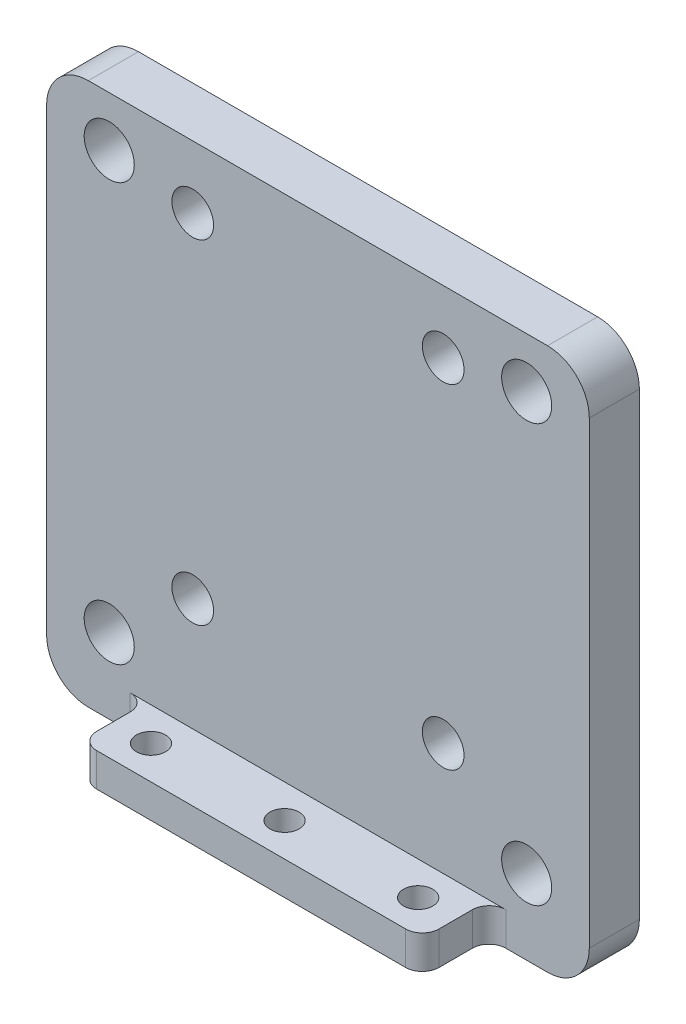
ISO-10303-21;
HEADER;
FILE_DESCRIPTION(('STEP AP214'),'2;1');
FILE_NAME('part.step','',(''),(''),'','','');
FILE_SCHEMA(('AUTOMOTIVE_DESIGN { 1 0 10303 214 1 1 1 1 }'));
ENDSEC;
DATA;
#1=APPLICATION_CONTEXT('core data for automotive mechanical design processes');
#2=APPLICATION_PROTOCOL_DEFINITION('international standard','automotive_design',2000,#1);
#3=PRODUCT_CONTEXT('',#1,'mechanical');
#4=PRODUCT('Part','Part','',(#3));
#5=PRODUCT_RELATED_PRODUCT_CATEGORY('part','',(#4));
#6=PRODUCT_DEFINITION_FORMATION('','',#4);
#7=PRODUCT_DEFINITION_CONTEXT('part definition',#1,'design');
#8=PRODUCT_DEFINITION('design','',#6,#7);
#9=PRODUCT_DEFINITION_SHAPE('','',#8);
#10=(LENGTH_UNIT() NAMED_UNIT(*) SI_UNIT(.MILLI.,.METRE.));
#11=(NAMED_UNIT(*) PLANE_ANGLE_UNIT() SI_UNIT($,.RADIAN.));
#12=(NAMED_UNIT(*) SI_UNIT($,.STERADIAN.) SOLID_ANGLE_UNIT());
#13=UNCERTAINTY_MEASURE_WITH_UNIT(LENGTH_MEASURE(1.E-05),#10,'distance_accuracy_value','');
#14=(GEOMETRIC_REPRESENTATION_CONTEXT(3) GLOBAL_UNCERTAINTY_ASSIGNED_CONTEXT((#13)) GLOBAL_UNIT_ASSIGNED_CONTEXT((#10,
#11,#12)) REPRESENTATION_CONTEXT('',''));
#15=CARTESIAN_POINT('',(0.,0.,0.));
#16=DIRECTION('',(0.,0.,1.));
#17=DIRECTION('',(1.,0.,0.));
#18=AXIS2_PLACEMENT_3D('',#15,#16,#17);
#19=CARTESIAN_POINT('',(0.,0.,6.));
#20=DIRECTION('',(0.,0.,1.));
#21=DIRECTION('',(1.,0.,0.));
#22=AXIS2_PLACEMENT_3D('',#19,#20,#21);
#23=PLANE('',#22);
#24=CARTESIAN_POINT('',(-15.,25.,6.));
#25=DIRECTION('',(0.,0.,1.));
#26=DIRECTION('',(1.,0.,0.));
#27=AXIS2_PLACEMENT_3D('',#24,#25,#26);
#28=CIRCLE('',#27,2.5);
#29=CARTESIAN_POINT('',(-12.5,25.,6.));
#30=VERTEX_POINT('',#29);
#31=EDGE_CURVE('E340',#30,#30,#28,.T.);
#32=ORIENTED_EDGE('',*,*,#31,.F.);
#33=EDGE_LOOP('',(#32));
#34=FACE_BOUND('',#33,.T.);
#35=CARTESIAN_POINT('',(15.,-15.,6.));
#36=DIRECTION('',(0.,0.,1.));
#37=DIRECTION('',(1.,0.,0.));
#38=AXIS2_PLACEMENT_3D('',#35,#36,#37);
#39=CIRCLE('',#38,2.5);
#40=CARTESIAN_POINT('',(17.5,-15.,6.));
#41=VERTEX_POINT('',#40);
#42=EDGE_CURVE('E336',#41,#41,#39,.T.);
#43=ORIENTED_EDGE('',*,*,#42,.F.);
#44=EDGE_LOOP('',(#43));
#45=FACE_BOUND('',#44,.T.);
#46=CARTESIAN_POINT('',(-15.,-15.,6.));
#47=DIRECTION('',(0.,0.,1.));
#48=DIRECTION('',(1.,0.,0.));
#49=AXIS2_PLACEMENT_3D('',#46,#47,#48);
#50=CIRCLE('',#49,2.5);
#51=CARTESIAN_POINT('',(-12.5,-15.,6.));
#52=VERTEX_POINT('',#51);
#53=EDGE_CURVE('E332',#52,#52,#50,.T.);
#54=ORIENTED_EDGE('',*,*,#53,.F.);
#55=EDGE_LOOP('',(#54));
#56=FACE_BOUND('',#55,.T.);
#57=CARTESIAN_POINT('',(15.,25.,6.));
#58=DIRECTION('',(0.,0.,1.));
#59=DIRECTION('',(1.,0.,0.));
#60=AXIS2_PLACEMENT_3D('',#57,#58,#59);
#61=CIRCLE('',#60,2.5);
#62=CARTESIAN_POINT('',(17.5,25.,6.));
#63=VERTEX_POINT('',#62);
#64=EDGE_CURVE('E328',#63,#63,#61,.T.);
#65=ORIENTED_EDGE('',*,*,#64,.F.);
#66=EDGE_LOOP('',(#65));
#67=FACE_BOUND('',#66,.T.);
#68=DIRECTION('',(-1.,0.,0.));
#69=VECTOR('',#68,1.);
#70=CARTESIAN_POINT('',(-20.5,-28.5,6.));
#71=LINE('',#70,#69);
#72=CARTESIAN_POINT('',(22.5,-28.5,6.));
#73=VERTEX_POINT('',#72);
#74=CARTESIAN_POINT('',(-22.5,-28.5,6.));
#75=VERTEX_POINT('',#74);
#76=EDGE_CURVE('E344',#73,#75,#71,.T.);
#77=ORIENTED_EDGE('',*,*,#76,.F.);
#78=DIRECTION('',(0.,1.,0.));
#79=VECTOR('',#78,1.);
#80=CARTESIAN_POINT('',(22.5,0.,6.));
#81=LINE('',#80,#79);
#82=CARTESIAN_POINT('',(22.5,-32.5,6.));
#83=VERTEX_POINT('',#82);
#84=EDGE_CURVE('E257',#73,#83,#81,.F.);
#85=ORIENTED_EDGE('',*,*,#84,.T.);
#86=DIRECTION('',(1.,0.,0.));
#87=VECTOR('',#86,1.);
#88=CARTESIAN_POINT('',(-32.5,-32.5,6.));
#89=LINE('',#88,#87);
#90=CARTESIAN_POINT('',(27.5,-32.5,6.));
#91=VERTEX_POINT('',#90);
#92=EDGE_CURVE('E405',#83,#91,#89,.T.);
#93=ORIENTED_EDGE('',*,*,#92,.T.);
#94=CARTESIAN_POINT('',(27.5,-27.5,6.));
#95=DIRECTION('',(0.,0.,1.));
#96=DIRECTION('',(1.,0.,0.));
#97=AXIS2_PLACEMENT_3D('',#94,#95,#96);
#98=CIRCLE('',#97,5.);
#99=CARTESIAN_POINT('',(32.5,-27.5,6.));
#100=VERTEX_POINT('',#99);
#101=EDGE_CURVE('E229',#91,#100,#98,.T.);
#102=ORIENTED_EDGE('',*,*,#101,.T.);
#103=DIRECTION('',(0.,1.,0.));
#104=VECTOR('',#103,1.);
#105=CARTESIAN_POINT('',(32.5,32.5,6.));
#106=LINE('',#105,#104);
#107=CARTESIAN_POINT('',(32.5,27.5,6.));
#108=VERTEX_POINT('',#107);
#109=EDGE_CURVE('E176',#100,#108,#106,.T.);
#110=ORIENTED_EDGE('',*,*,#109,.T.);
#111=CARTESIAN_POINT('',(27.5,27.5,6.));
#112=DIRECTION('',(0.,0.,1.));
#113=DIRECTION('',(1.,0.,0.));
#114=AXIS2_PLACEMENT_3D('',#111,#112,#113);
#115=CIRCLE('',#114,5.);
#116=CARTESIAN_POINT('',(27.5,32.5,6.));
#117=VERTEX_POINT('',#116);
#118=EDGE_CURVE('E223',#108,#117,#115,.T.);
#119=ORIENTED_EDGE('',*,*,#118,.T.);
#120=DIRECTION('',(-1.,0.,0.));
#121=VECTOR('',#120,1.);
#122=CARTESIAN_POINT('',(-32.5,32.5,6.));
#123=LINE('',#122,#121);
#124=CARTESIAN_POINT('',(-27.5,32.5,6.));
#125=VERTEX_POINT('',#124);
#126=EDGE_CURVE('E399',#117,#125,#123,.T.);
#127=ORIENTED_EDGE('',*,*,#126,.T.);
#128=CARTESIAN_POINT('',(-27.5,27.5,6.));
#129=DIRECTION('',(0.,0.,1.));
#130=DIRECTION('',(1.,0.,0.));
#131=AXIS2_PLACEMENT_3D('',#128,#129,#130);
#132=CIRCLE('',#131,5.);
#133=CARTESIAN_POINT('',(-32.5,27.5,6.));
#134=VERTEX_POINT('',#133);
#135=EDGE_CURVE('E220',#125,#134,#132,.T.);
#136=ORIENTED_EDGE('',*,*,#135,.T.);
#137=DIRECTION('',(0.,-1.,0.));
#138=VECTOR('',#137,1.);
#139=CARTESIAN_POINT('',(-32.5,32.5,6.));
#140=LINE('',#139,#138);
#141=CARTESIAN_POINT('',(-32.5,-27.5,6.));
#142=VERTEX_POINT('',#141);
#143=EDGE_CURVE('E402',#134,#142,#140,.T.);
#144=ORIENTED_EDGE('',*,*,#143,.T.);
#145=CARTESIAN_POINT('',(-27.5,-27.5,6.));
#146=DIRECTION('',(0.,0.,1.));
#147=DIRECTION('',(1.,0.,0.));
#148=AXIS2_PLACEMENT_3D('',#145,#146,#147);
#149=CIRCLE('',#148,5.);
#150=CARTESIAN_POINT('',(-27.5,-32.5,6.));
#151=VERTEX_POINT('',#150);
#152=EDGE_CURVE('E226',#142,#151,#149,.T.);
#153=ORIENTED_EDGE('',*,*,#152,.T.);
#154=CARTESIAN_POINT('',(-22.5,-32.5,6.));
#155=VERTEX_POINT('',#154);
#156=EDGE_CURVE('E198',#151,#155,#89,.T.);
#157=ORIENTED_EDGE('',*,*,#156,.T.);
#158=DIRECTION('',(0.,-1.,0.));
#159=VECTOR('',#158,1.);
#160=CARTESIAN_POINT('',(-22.5,0.,6.));
#161=LINE('',#160,#159);
#162=EDGE_CURVE('E253',#155,#75,#161,.F.);
#163=ORIENTED_EDGE('',*,*,#162,.T.);
#164=EDGE_LOOP('',(#77,#85,#93,#102,#110,#119,#127,#136,#144,#153,#157,#163));
#165=FACE_BOUND('',#164,.T.);
#166=CARTESIAN_POINT('',(-25.,-23.5,6.));
#167=DIRECTION('',(0.,0.,1.));
#168=DIRECTION('',(1.,0.,0.));
#169=AXIS2_PLACEMENT_3D('',#166,#167,#168);
#170=CIRCLE('',#169,3.);
#171=CARTESIAN_POINT('',(-22.,-23.5,6.));
#172=VERTEX_POINT('',#171);
#173=EDGE_CURVE('E379',#172,#172,#170,.T.);
#174=ORIENTED_EDGE('',*,*,#173,.F.);
#175=EDGE_LOOP('',(#174));
#176=FACE_BOUND('',#175,.T.);
#177=CARTESIAN_POINT('',(25.,26.5,6.));
#178=DIRECTION('',(0.,0.,1.));
#179=DIRECTION('',(1.,0.,0.));
#180=AXIS2_PLACEMENT_3D('',#177,#178,#179);
#181=CIRCLE('',#180,3.);
#182=CARTESIAN_POINT('',(28.,26.5,6.));
#183=VERTEX_POINT('',#182);
#184=EDGE_CURVE('E187',#183,#183,#181,.T.);
#185=ORIENTED_EDGE('',*,*,#184,.F.);
#186=EDGE_LOOP('',(#185));
#187=FACE_BOUND('',#186,.T.);
#188=CARTESIAN_POINT('',(25.,-23.5,6.));
#189=DIRECTION('',(0.,0.,1.));
#190=DIRECTION('',(1.,0.,0.));
#191=AXIS2_PLACEMENT_3D('',#188,#189,#190);
#192=CIRCLE('',#191,3.);
#193=CARTESIAN_POINT('',(28.,-23.5,6.));
#194=VERTEX_POINT('',#193);
#195=EDGE_CURVE('E387',#194,#194,#192,.T.);
#196=ORIENTED_EDGE('',*,*,#195,.F.);
#197=EDGE_LOOP('',(#196));
#198=FACE_BOUND('',#197,.T.);
#199=CARTESIAN_POINT('',(-25.,26.5,6.));
#200=DIRECTION('',(0.,0.,1.));
#201=DIRECTION('',(1.,0.,0.));
#202=AXIS2_PLACEMENT_3D('',#199,#200,#201);
#203=CIRCLE('',#202,3.);
#204=CARTESIAN_POINT('',(-22.,26.5,6.));
#205=VERTEX_POINT('',#204);
#206=EDGE_CURVE('E371',#205,#205,#203,.T.);
#207=ORIENTED_EDGE('',*,*,#206,.F.);
#208=EDGE_LOOP('',(#207));
#209=FACE_BOUND('',#208,.T.);
#210=ADVANCED_FACE('F38',(#34,#45,#56,#67,#165,#176,#187,#198,#209),#23,.T.);
#211=CARTESIAN_POINT('',(0.,0.,0.));
#212=DIRECTION('',(0.,0.,1.));
#213=DIRECTION('',(1.,0.,0.));
#214=AXIS2_PLACEMENT_3D('',#211,#212,#213);
#215=PLANE('',#214);
#216=CARTESIAN_POINT('',(-15.,25.,0.));
#217=DIRECTION('',(0.,0.,-1.));
#218=DIRECTION('',(-1.,0.,0.));
#219=AXIS2_PLACEMENT_3D('',#216,#217,#218);
#220=CIRCLE('',#219,2.5);
#221=CARTESIAN_POINT('',(-17.5,25.,0.));
#222=VERTEX_POINT('',#221);
#223=EDGE_CURVE('E316',#222,#222,#220,.T.);
#224=ORIENTED_EDGE('',*,*,#223,.F.);
#225=EDGE_LOOP('',(#224));
#226=FACE_BOUND('',#225,.T.);
#227=CARTESIAN_POINT('',(15.,-15.,0.));
#228=DIRECTION('',(0.,0.,-1.));
#229=DIRECTION('',(-1.,0.,0.));
#230=AXIS2_PLACEMENT_3D('',#227,#228,#229);
#231=CIRCLE('',#230,2.5);
#232=CARTESIAN_POINT('',(12.5,-15.,0.));
#233=VERTEX_POINT('',#232);
#234=EDGE_CURVE('E310',#233,#233,#231,.T.);
#235=ORIENTED_EDGE('',*,*,#234,.F.);
#236=EDGE_LOOP('',(#235));
#237=FACE_BOUND('',#236,.T.);
#238=CARTESIAN_POINT('',(-15.,-15.,0.));
#239=DIRECTION('',(0.,0.,-1.));
#240=DIRECTION('',(-1.,0.,0.));
#241=AXIS2_PLACEMENT_3D('',#238,#239,#240);
#242=CIRCLE('',#241,2.5);
#243=CARTESIAN_POINT('',(-17.5,-15.,0.));
#244=VERTEX_POINT('',#243);
#245=EDGE_CURVE('E305',#244,#244,#242,.T.);
#246=ORIENTED_EDGE('',*,*,#245,.F.);
#247=EDGE_LOOP('',(#246));
#248=FACE_BOUND('',#247,.T.);
#249=CARTESIAN_POINT('',(15.,25.,0.));
#250=DIRECTION('',(0.,0.,-1.));
#251=DIRECTION('',(-1.,0.,0.));
#252=AXIS2_PLACEMENT_3D('',#249,#250,#251);
#253=CIRCLE('',#252,2.5);
#254=CARTESIAN_POINT('',(12.5,25.,0.));
#255=VERTEX_POINT('',#254);
#256=EDGE_CURVE('E323',#255,#255,#253,.T.);
#257=ORIENTED_EDGE('',*,*,#256,.F.);
#258=EDGE_LOOP('',(#257));
#259=FACE_BOUND('',#258,.T.);
#260=DIRECTION('',(0.,1.,0.));
#261=VECTOR('',#260,1.);
#262=CARTESIAN_POINT('',(32.5,32.5,0.));
#263=LINE('',#262,#261);
#264=CARTESIAN_POINT('',(32.5,-27.5,0.));
#265=VERTEX_POINT('',#264);
#266=CARTESIAN_POINT('',(32.5,27.5,0.));
#267=VERTEX_POINT('',#266);
#268=EDGE_CURVE('E173',#265,#267,#263,.T.);
#269=ORIENTED_EDGE('',*,*,#268,.F.);
#270=CARTESIAN_POINT('',(27.5,-27.5,0.));
#271=DIRECTION('',(0.,0.,1.));
#272=DIRECTION('',(1.,0.,0.));
#273=AXIS2_PLACEMENT_3D('',#270,#271,#272);
#274=CIRCLE('',#273,5.);
#275=CARTESIAN_POINT('',(27.5,-32.5,0.));
#276=VERTEX_POINT('',#275);
#277=EDGE_CURVE('E154',#265,#276,#274,.F.);
#278=ORIENTED_EDGE('',*,*,#277,.T.);
#279=DIRECTION('',(1.,0.,0.));
#280=VECTOR('',#279,1.);
#281=CARTESIAN_POINT('',(-32.5,-32.5,0.));
#282=LINE('',#281,#280);
#283=CARTESIAN_POINT('',(-27.5,-32.5,0.));
#284=VERTEX_POINT('',#283);
#285=EDGE_CURVE('E204',#284,#276,#282,.T.);
#286=ORIENTED_EDGE('',*,*,#285,.F.);
#287=CARTESIAN_POINT('',(-27.5,-27.5,0.));
#288=DIRECTION('',(0.,0.,1.));
#289=DIRECTION('',(1.,0.,0.));
#290=AXIS2_PLACEMENT_3D('',#287,#288,#289);
#291=CIRCLE('',#290,5.);
#292=CARTESIAN_POINT('',(-32.5,-27.5,0.));
#293=VERTEX_POINT('',#292);
#294=EDGE_CURVE('E167',#284,#293,#291,.F.);
#295=ORIENTED_EDGE('',*,*,#294,.T.);
#296=DIRECTION('',(0.,-1.,0.));
#297=VECTOR('',#296,1.);
#298=CARTESIAN_POINT('',(-32.5,32.5,0.));
#299=LINE('',#298,#297);
#300=CARTESIAN_POINT('',(-32.5,27.5,0.));
#301=VERTEX_POINT('',#300);
#302=EDGE_CURVE('E192',#301,#293,#299,.T.);
#303=ORIENTED_EDGE('',*,*,#302,.F.);
#304=CARTESIAN_POINT('',(-27.5,27.5,0.));
#305=DIRECTION('',(0.,0.,1.));
#306=DIRECTION('',(1.,0.,0.));
#307=AXIS2_PLACEMENT_3D('',#304,#305,#306);
#308=CIRCLE('',#307,5.);
#309=CARTESIAN_POINT('',(-27.5,32.5,0.));
#310=VERTEX_POINT('',#309);
#311=EDGE_CURVE('E178',#301,#310,#308,.F.);
#312=ORIENTED_EDGE('',*,*,#311,.T.);
#313=DIRECTION('',(-1.,0.,0.));
#314=VECTOR('',#313,1.);
#315=CARTESIAN_POINT('',(-32.5,32.5,0.));
#316=LINE('',#315,#314);
#317=CARTESIAN_POINT('',(27.5,32.5,0.));
#318=VERTEX_POINT('',#317);
#319=EDGE_CURVE('E186',#318,#310,#316,.T.);
#320=ORIENTED_EDGE('',*,*,#319,.F.);
#321=CARTESIAN_POINT('',(27.5,27.5,0.));
#322=DIRECTION('',(0.,0.,1.));
#323=DIRECTION('',(1.,0.,0.));
#324=AXIS2_PLACEMENT_3D('',#321,#322,#323);
#325=CIRCLE('',#324,5.);
#326=EDGE_CURVE('E184',#318,#267,#325,.F.);
#327=ORIENTED_EDGE('',*,*,#326,.T.);
#328=EDGE_LOOP('',(#269,#278,#286,#295,#303,#312,#320,#327));
#329=FACE_BOUND('',#328,.T.);
#330=CARTESIAN_POINT('',(25.,26.5,0.));
#331=DIRECTION('',(0.,0.,1.));
#332=DIRECTION('',(1.,0.,0.));
#333=AXIS2_PLACEMENT_3D('',#330,#331,#332);
#334=CIRCLE('',#333,3.);
#335=CARTESIAN_POINT('',(28.,26.5,0.));
#336=VERTEX_POINT('',#335);
#337=EDGE_CURVE('E195',#336,#336,#334,.T.);
#338=ORIENTED_EDGE('',*,*,#337,.T.);
#339=EDGE_LOOP('',(#338));
#340=FACE_BOUND('',#339,.T.);
#341=CARTESIAN_POINT('',(25.,-23.5,0.));
#342=DIRECTION('',(0.,0.,1.));
#343=DIRECTION('',(1.,0.,0.));
#344=AXIS2_PLACEMENT_3D('',#341,#342,#343);
#345=CIRCLE('',#344,3.);
#346=CARTESIAN_POINT('',(28.,-23.5,0.));
#347=VERTEX_POINT('',#346);
#348=EDGE_CURVE('E383',#347,#347,#345,.T.);
#349=ORIENTED_EDGE('',*,*,#348,.T.);
#350=EDGE_LOOP('',(#349));
#351=FACE_BOUND('',#350,.T.);
#352=CARTESIAN_POINT('',(-25.,-23.5,0.));
#353=DIRECTION('',(0.,0.,1.));
#354=DIRECTION('',(1.,0.,0.));
#355=AXIS2_PLACEMENT_3D('',#352,#353,#354);
#356=CIRCLE('',#355,3.);
#357=CARTESIAN_POINT('',(-22.,-23.5,0.));
#358=VERTEX_POINT('',#357);
#359=EDGE_CURVE('E375',#358,#358,#356,.T.);
#360=ORIENTED_EDGE('',*,*,#359,.T.);
#361=EDGE_LOOP('',(#360));
#362=FACE_BOUND('',#361,.T.);
#363=CARTESIAN_POINT('',(-25.,26.5,0.));
#364=DIRECTION('',(0.,0.,1.));
#365=DIRECTION('',(1.,0.,0.));
#366=AXIS2_PLACEMENT_3D('',#363,#364,#365);
#367=CIRCLE('',#366,3.);
#368=CARTESIAN_POINT('',(-22.,26.5,0.));
#369=VERTEX_POINT('',#368);
#370=EDGE_CURVE('E370',#369,#369,#367,.T.);
#371=ORIENTED_EDGE('',*,*,#370,.T.);
#372=EDGE_LOOP('',(#371));
#373=FACE_BOUND('',#372,.T.);
#374=ADVANCED_FACE('F181',(#226,#237,#248,#259,#329,#340,#351,#362,#373),#215,.F.);
#375=CARTESIAN_POINT('',(32.5,32.5,6.));
#376=DIRECTION('',(-1.,0.,0.));
#377=DIRECTION('',(0.,-1.,0.));
#378=AXIS2_PLACEMENT_3D('',#375,#376,#377);
#379=PLANE('',#378);
#380=ORIENTED_EDGE('',*,*,#109,.F.);
#381=DIRECTION('',(0.,0.,-1.));
#382=VECTOR('',#381,1.);
#383=CARTESIAN_POINT('',(32.5,-27.5,6.));
#384=LINE('',#383,#382);
#385=EDGE_CURVE('E158',#100,#265,#384,.T.);
#386=ORIENTED_EDGE('',*,*,#385,.T.);
#387=ORIENTED_EDGE('',*,*,#268,.T.);
#388=DIRECTION('',(0.,0.,-1.));
#389=VECTOR('',#388,1.);
#390=CARTESIAN_POINT('',(32.5,27.5,6.));
#391=LINE('',#390,#389);
#392=EDGE_CURVE('E179',#267,#108,#391,.F.);
#393=ORIENTED_EDGE('',*,*,#392,.T.);
#394=EDGE_LOOP('',(#380,#386,#387,#393));
#395=FACE_BOUND('',#394,.T.);
#396=ADVANCED_FACE('F172',(#395),#379,.F.);
#397=CARTESIAN_POINT('',(-32.5,32.5,6.));
#398=DIRECTION('',(0.,-1.,0.));
#399=DIRECTION('',(0.,0.,-1.));
#400=AXIS2_PLACEMENT_3D('',#397,#398,#399);
#401=PLANE('',#400);
#402=ORIENTED_EDGE('',*,*,#126,.F.);
#403=DIRECTION('',(0.,0.,-1.));
#404=VECTOR('',#403,1.);
#405=CARTESIAN_POINT('',(27.5,32.5,6.));
#406=LINE('',#405,#404);
#407=EDGE_CURVE('E242',#117,#318,#406,.T.);
#408=ORIENTED_EDGE('',*,*,#407,.T.);
#409=ORIENTED_EDGE('',*,*,#319,.T.);
#410=DIRECTION('',(0.,0.,-1.));
#411=VECTOR('',#410,1.);
#412=CARTESIAN_POINT('',(-27.5,32.5,6.));
#413=LINE('',#412,#411);
#414=EDGE_CURVE('E239',#310,#125,#413,.F.);
#415=ORIENTED_EDGE('',*,*,#414,.T.);
#416=EDGE_LOOP('',(#402,#408,#409,#415));
#417=FACE_BOUND('',#416,.T.);
#418=ADVANCED_FACE('F451',(#417),#401,.F.);
#419=CARTESIAN_POINT('',(-32.5,32.5,6.));
#420=DIRECTION('',(1.,0.,0.));
#421=DIRECTION('',(0.,1.,0.));
#422=AXIS2_PLACEMENT_3D('',#419,#420,#421);
#423=PLANE('',#422);
#424=ORIENTED_EDGE('',*,*,#302,.T.);
#425=DIRECTION('',(0.,0.,-1.));
#426=VECTOR('',#425,1.);
#427=CARTESIAN_POINT('',(-32.5,-27.5,6.));
#428=LINE('',#427,#426);
#429=EDGE_CURVE('E236',#293,#142,#428,.F.);
#430=ORIENTED_EDGE('',*,*,#429,.T.);
#431=ORIENTED_EDGE('',*,*,#143,.F.);
#432=DIRECTION('',(0.,0.,-1.));
#433=VECTOR('',#432,1.);
#434=CARTESIAN_POINT('',(-32.5,27.5,6.));
#435=LINE('',#434,#433);
#436=EDGE_CURVE('E232',#134,#301,#435,.T.);
#437=ORIENTED_EDGE('',*,*,#436,.T.);
#438=EDGE_LOOP('',(#424,#430,#431,#437));
#439=FACE_BOUND('',#438,.T.);
#440=ADVANCED_FACE('F459',(#439),#423,.F.);
#441=CARTESIAN_POINT('',(-32.5,-32.5,6.));
#442=DIRECTION('',(0.,1.,0.));
#443=DIRECTION('',(0.,0.,1.));
#444=AXIS2_PLACEMENT_3D('',#441,#442,#443);
#445=PLANE('',#444);
#446=CARTESIAN_POINT('',(16.,-32.5,10.));
#447=DIRECTION('',(0.,-1.,0.));
#448=DIRECTION('',(0.,0.,-1.));
#449=AXIS2_PLACEMENT_3D('',#446,#447,#448);
#450=CIRCLE('',#449,1.75);
#451=CARTESIAN_POINT('',(16.,-32.5,8.25));
#452=VERTEX_POINT('',#451);
#453=EDGE_CURVE('E713',#452,#452,#450,.T.);
#454=ORIENTED_EDGE('',*,*,#453,.F.);
#455=EDGE_LOOP('',(#454));
#456=FACE_BOUND('',#455,.T.);
#457=CARTESIAN_POINT('',(-16.,-32.5,10.));
#458=DIRECTION('',(0.,-1.,0.));
#459=DIRECTION('',(0.,0.,-1.));
#460=AXIS2_PLACEMENT_3D('',#457,#458,#459);
#461=CIRCLE('',#460,1.75);
#462=CARTESIAN_POINT('',(-16.,-32.5,8.25));
#463=VERTEX_POINT('',#462);
#464=EDGE_CURVE('E715',#463,#463,#461,.T.);
#465=ORIENTED_EDGE('',*,*,#464,.F.);
#466=EDGE_LOOP('',(#465));
#467=FACE_BOUND('',#466,.T.);
#468=CARTESIAN_POINT('',(0.,-32.5,10.));
#469=DIRECTION('',(0.,-1.,0.));
#470=DIRECTION('',(0.,0.,-1.));
#471=AXIS2_PLACEMENT_3D('',#468,#469,#470);
#472=CIRCLE('',#471,1.75);
#473=CARTESIAN_POINT('',(0.,-32.5,8.25));
#474=VERTEX_POINT('',#473);
#475=EDGE_CURVE('E298',#474,#474,#472,.T.);
#476=ORIENTED_EDGE('',*,*,#475,.F.);
#477=EDGE_LOOP('',(#476));
#478=FACE_BOUND('',#477,.T.);
#479=DIRECTION('',(0.,0.,-1.));
#480=VECTOR('',#479,1.);
#481=CARTESIAN_POINT('',(20.5,-32.5,14.));
#482=LINE('',#481,#480);
#483=CARTESIAN_POINT('',(20.5,-32.5,12.));
#484=VERTEX_POINT('',#483);
#485=CARTESIAN_POINT('',(20.5,-32.5,8.));
#486=VERTEX_POINT('',#485);
#487=EDGE_CURVE('E363',#484,#486,#482,.T.);
#488=ORIENTED_EDGE('',*,*,#487,.F.);
#489=CARTESIAN_POINT('',(18.5,-32.5,12.));
#490=DIRECTION('',(0.,1.,0.));
#491=DIRECTION('',(0.,0.,1.));
#492=AXIS2_PLACEMENT_3D('',#489,#490,#491);
#493=CIRCLE('',#492,2.);
#494=CARTESIAN_POINT('',(18.5,-32.5,14.));
#495=VERTEX_POINT('',#494);
#496=EDGE_CURVE('E276',#484,#495,#493,.F.);
#497=ORIENTED_EDGE('',*,*,#496,.T.);
#498=DIRECTION('',(1.,0.,0.));
#499=VECTOR('',#498,1.);
#500=CARTESIAN_POINT('',(-20.5,-32.5,14.));
#501=LINE('',#500,#499);
#502=CARTESIAN_POINT('',(-18.5,-32.5,14.));
#503=VERTEX_POINT('',#502);
#504=EDGE_CURVE('E345',#503,#495,#501,.T.);
#505=ORIENTED_EDGE('',*,*,#504,.F.);
#506=CARTESIAN_POINT('',(-18.5,-32.5,12.));
#507=DIRECTION('',(0.,1.,0.));
#508=DIRECTION('',(0.,0.,1.));
#509=AXIS2_PLACEMENT_3D('',#506,#507,#508);
#510=CIRCLE('',#509,2.);
#511=CARTESIAN_POINT('',(-20.5,-32.5,12.));
#512=VERTEX_POINT('',#511);
#513=EDGE_CURVE('E63',#503,#512,#510,.F.);
#514=ORIENTED_EDGE('',*,*,#513,.T.);
#515=DIRECTION('',(0.,0.,-1.));
#516=VECTOR('',#515,1.);
#517=CARTESIAN_POINT('',(-20.5,-32.5,14.));
#518=LINE('',#517,#516);
#519=CARTESIAN_POINT('',(-20.5,-32.5,8.));
#520=VERTEX_POINT('',#519);
#521=EDGE_CURVE('E367',#512,#520,#518,.T.);
#522=ORIENTED_EDGE('',*,*,#521,.T.);
#523=CARTESIAN_POINT('',(-22.5,-32.5,8.));
#524=DIRECTION('',(0.,1.,0.));
#525=DIRECTION('',(0.,0.,1.));
#526=AXIS2_PLACEMENT_3D('',#523,#524,#525);
#527=CIRCLE('',#526,2.);
#528=EDGE_CURVE('E48',#520,#155,#527,.T.);
#529=ORIENTED_EDGE('',*,*,#528,.T.);
#530=ORIENTED_EDGE('',*,*,#156,.F.);
#531=DIRECTION('',(0.,0.,-1.));
#532=VECTOR('',#531,1.);
#533=CARTESIAN_POINT('',(-27.5,-32.5,6.));
#534=LINE('',#533,#532);
#535=EDGE_CURVE('E166',#151,#284,#534,.T.);
#536=ORIENTED_EDGE('',*,*,#535,.T.);
#537=ORIENTED_EDGE('',*,*,#285,.T.);
#538=DIRECTION('',(0.,0.,-1.));
#539=VECTOR('',#538,1.);
#540=CARTESIAN_POINT('',(27.5,-32.5,6.));
#541=LINE('',#540,#539);
#542=EDGE_CURVE('E160',#276,#91,#541,.F.);
#543=ORIENTED_EDGE('',*,*,#542,.T.);
#544=ORIENTED_EDGE('',*,*,#92,.F.);
#545=CARTESIAN_POINT('',(22.5,-32.5,8.));
#546=DIRECTION('',(0.,1.,0.));
#547=DIRECTION('',(0.,0.,1.));
#548=AXIS2_PLACEMENT_3D('',#545,#546,#547);
#549=CIRCLE('',#548,2.);
#550=EDGE_CURVE('E289',#83,#486,#549,.T.);
#551=ORIENTED_EDGE('',*,*,#550,.T.);
#552=EDGE_LOOP('',(#488,#497,#505,#514,#522,#529,#530,#536,#537,#543,#544,#551));
#553=FACE_BOUND('',#552,.T.);
#554=ADVANCED_FACE('F444',(#456,#467,#478,#553),#445,.F.);
#555=CARTESIAN_POINT('',(25.,26.5,6.));
#556=DIRECTION('',(0.,0.,-1.));
#557=DIRECTION('',(-1.,0.,0.));
#558=AXIS2_PLACEMENT_3D('',#555,#556,#557);
#559=CYLINDRICAL_SURFACE('',#558,3.);
#560=ORIENTED_EDGE('',*,*,#184,.T.);
#561=EDGE_LOOP('',(#560));
#562=FACE_BOUND('',#561,.T.);
#563=ORIENTED_EDGE('',*,*,#337,.F.);
#564=EDGE_LOOP('',(#563));
#565=FACE_BOUND('',#564,.T.);
#566=ADVANCED_FACE('F483',(#562,#565),#559,.F.);
#567=CARTESIAN_POINT('',(25.,-23.5,6.));
#568=DIRECTION('',(0.,0.,-1.));
#569=DIRECTION('',(-1.,0.,0.));
#570=AXIS2_PLACEMENT_3D('',#567,#568,#569);
#571=CYLINDRICAL_SURFACE('',#570,3.);
#572=ORIENTED_EDGE('',*,*,#195,.T.);
#573=EDGE_LOOP('',(#572));
#574=FACE_BOUND('',#573,.T.);
#575=ORIENTED_EDGE('',*,*,#348,.F.);
#576=EDGE_LOOP('',(#575));
#577=FACE_BOUND('',#576,.T.);
#578=ADVANCED_FACE('F525',(#574,#577),#571,.F.);
#579=CARTESIAN_POINT('',(-25.,-23.5,6.));
#580=DIRECTION('',(0.,0.,-1.));
#581=DIRECTION('',(-1.,0.,0.));
#582=AXIS2_PLACEMENT_3D('',#579,#580,#581);
#583=CYLINDRICAL_SURFACE('',#582,3.);
#584=ORIENTED_EDGE('',*,*,#173,.T.);
#585=EDGE_LOOP('',(#584));
#586=FACE_BOUND('',#585,.T.);
#587=ORIENTED_EDGE('',*,*,#359,.F.);
#588=EDGE_LOOP('',(#587));
#589=FACE_BOUND('',#588,.T.);
#590=ADVANCED_FACE('F532',(#586,#589),#583,.F.);
#591=CARTESIAN_POINT('',(-25.,26.5,6.));
#592=DIRECTION('',(0.,0.,-1.));
#593=DIRECTION('',(-1.,0.,0.));
#594=AXIS2_PLACEMENT_3D('',#591,#592,#593);
#595=CYLINDRICAL_SURFACE('',#594,3.);
#596=ORIENTED_EDGE('',*,*,#206,.T.);
#597=EDGE_LOOP('',(#596));
#598=FACE_BOUND('',#597,.T.);
#599=ORIENTED_EDGE('',*,*,#370,.F.);
#600=EDGE_LOOP('',(#599));
#601=FACE_BOUND('',#600,.T.);
#602=ADVANCED_FACE('F470',(#598,#601),#595,.F.);
#603=CARTESIAN_POINT('',(27.5,-27.5,6.));
#604=DIRECTION('',(0.,0.,-1.));
#605=DIRECTION('',(-1.,0.,0.));
#606=AXIS2_PLACEMENT_3D('',#603,#604,#605);
#607=CYLINDRICAL_SURFACE('',#606,5.);
#608=ORIENTED_EDGE('',*,*,#101,.F.);
#609=ORIENTED_EDGE('',*,*,#542,.F.);
#610=ORIENTED_EDGE('',*,*,#277,.F.);
#611=ORIENTED_EDGE('',*,*,#385,.F.);
#612=EDGE_LOOP('',(#608,#609,#610,#611));
#613=FACE_BOUND('',#612,.T.);
#614=ADVANCED_FACE('F157',(#613),#607,.T.);
#615=CARTESIAN_POINT('',(-27.5,-27.5,6.));
#616=DIRECTION('',(0.,0.,-1.));
#617=DIRECTION('',(-1.,0.,0.));
#618=AXIS2_PLACEMENT_3D('',#615,#616,#617);
#619=CYLINDRICAL_SURFACE('',#618,5.);
#620=ORIENTED_EDGE('',*,*,#152,.F.);
#621=ORIENTED_EDGE('',*,*,#429,.F.);
#622=ORIENTED_EDGE('',*,*,#294,.F.);
#623=ORIENTED_EDGE('',*,*,#535,.F.);
#624=EDGE_LOOP('',(#620,#621,#622,#623));
#625=FACE_BOUND('',#624,.T.);
#626=ADVANCED_FACE('F462',(#625),#619,.T.);
#627=CARTESIAN_POINT('',(27.5,27.5,6.));
#628=DIRECTION('',(0.,0.,-1.));
#629=DIRECTION('',(-1.,0.,0.));
#630=AXIS2_PLACEMENT_3D('',#627,#628,#629);
#631=CYLINDRICAL_SURFACE('',#630,5.);
#632=ORIENTED_EDGE('',*,*,#118,.F.);
#633=ORIENTED_EDGE('',*,*,#392,.F.);
#634=ORIENTED_EDGE('',*,*,#326,.F.);
#635=ORIENTED_EDGE('',*,*,#407,.F.);
#636=EDGE_LOOP('',(#632,#633,#634,#635));
#637=FACE_BOUND('',#636,.T.);
#638=ADVANCED_FACE('F449',(#637),#631,.T.);
#639=CARTESIAN_POINT('',(-27.5,27.5,6.));
#640=DIRECTION('',(0.,0.,-1.));
#641=DIRECTION('',(-1.,0.,0.));
#642=AXIS2_PLACEMENT_3D('',#639,#640,#641);
#643=CYLINDRICAL_SURFACE('',#642,5.);
#644=ORIENTED_EDGE('',*,*,#135,.F.);
#645=ORIENTED_EDGE('',*,*,#414,.F.);
#646=ORIENTED_EDGE('',*,*,#311,.F.);
#647=ORIENTED_EDGE('',*,*,#436,.F.);
#648=EDGE_LOOP('',(#644,#645,#646,#647));
#649=FACE_BOUND('',#648,.T.);
#650=ADVANCED_FACE('F457',(#649),#643,.T.);
#651=CARTESIAN_POINT('',(-20.5,-32.5,14.));
#652=DIRECTION('',(1.,0.,0.));
#653=DIRECTION('',(0.,0.,-1.));
#654=AXIS2_PLACEMENT_3D('',#651,#652,#653);
#655=PLANE('',#654);
#656=ORIENTED_EDGE('',*,*,#521,.F.);
#657=DIRECTION('',(0.,-1.,0.));
#658=VECTOR('',#657,1.);
#659=CARTESIAN_POINT('',(-20.5,-32.5,12.));
#660=LINE('',#659,#658);
#661=CARTESIAN_POINT('',(-20.5,-28.5,12.));
#662=VERTEX_POINT('',#661);
#663=EDGE_CURVE('E282',#512,#662,#660,.F.);
#664=ORIENTED_EDGE('',*,*,#663,.T.);
#665=DIRECTION('',(0.,0.,-1.));
#666=VECTOR('',#665,1.);
#667=CARTESIAN_POINT('',(-20.5,-28.5,14.));
#668=LINE('',#667,#666);
#669=CARTESIAN_POINT('',(-20.5,-28.5,8.));
#670=VERTEX_POINT('',#669);
#671=EDGE_CURVE('E353',#662,#670,#668,.T.);
#672=ORIENTED_EDGE('',*,*,#671,.T.);
#673=DIRECTION('',(0.,-1.,0.));
#674=VECTOR('',#673,1.);
#675=CARTESIAN_POINT('',(-20.5,-32.5,8.));
#676=LINE('',#675,#674);
#677=EDGE_CURVE('E279',#670,#520,#676,.T.);
#678=ORIENTED_EDGE('',*,*,#677,.T.);
#679=EDGE_LOOP('',(#656,#664,#672,#678));
#680=FACE_BOUND('',#679,.T.);
#681=ADVANCED_FACE('F423',(#680),#655,.F.);
#682=CARTESIAN_POINT('',(20.5,-32.5,14.));
#683=DIRECTION('',(-1.,0.,0.));
#684=DIRECTION('',(0.,0.,1.));
#685=AXIS2_PLACEMENT_3D('',#682,#683,#684);
#686=PLANE('',#685);
#687=ORIENTED_EDGE('',*,*,#487,.T.);
#688=DIRECTION('',(0.,1.,0.));
#689=VECTOR('',#688,1.);
#690=CARTESIAN_POINT('',(20.5,-32.5,8.));
#691=LINE('',#690,#689);
#692=CARTESIAN_POINT('',(20.5,-28.5,8.));
#693=VERTEX_POINT('',#692);
#694=EDGE_CURVE('E249',#486,#693,#691,.T.);
#695=ORIENTED_EDGE('',*,*,#694,.T.);
#696=DIRECTION('',(0.,0.,-1.));
#697=VECTOR('',#696,1.);
#698=CARTESIAN_POINT('',(20.5,-28.5,14.));
#699=LINE('',#698,#697);
#700=CARTESIAN_POINT('',(20.5,-28.5,12.));
#701=VERTEX_POINT('',#700);
#702=EDGE_CURVE('E359',#701,#693,#699,.T.);
#703=ORIENTED_EDGE('',*,*,#702,.F.);
#704=DIRECTION('',(0.,1.,0.));
#705=VECTOR('',#704,1.);
#706=CARTESIAN_POINT('',(20.5,-32.5,12.));
#707=LINE('',#706,#705);
#708=EDGE_CURVE('E246',#701,#484,#707,.F.);
#709=ORIENTED_EDGE('',*,*,#708,.T.);
#710=EDGE_LOOP('',(#687,#695,#703,#709));
#711=FACE_BOUND('',#710,.T.);
#712=ADVANCED_FACE('F437',(#711),#686,.F.);
#713=CARTESIAN_POINT('',(-20.5,-28.5,14.));
#714=DIRECTION('',(0.,-1.,0.));
#715=DIRECTION('',(1.,0.,0.));
#716=AXIS2_PLACEMENT_3D('',#713,#714,#715);
#717=PLANE('',#716);
#718=CARTESIAN_POINT('',(16.,-28.5,10.));
#719=DIRECTION('',(0.,-1.,0.));
#720=DIRECTION('',(1.,0.,0.));
#721=AXIS2_PLACEMENT_3D('',#718,#719,#720);
#722=CIRCLE('',#721,1.75);
#723=CARTESIAN_POINT('',(17.75,-28.5,10.));
#724=VERTEX_POINT('',#723);
#725=EDGE_CURVE('E42',#724,#724,#722,.T.);
#726=ORIENTED_EDGE('',*,*,#725,.T.);
#727=EDGE_LOOP('',(#726));
#728=FACE_BOUND('',#727,.T.);
#729=CARTESIAN_POINT('',(-16.,-28.5,10.));
#730=DIRECTION('',(0.,-1.,0.));
#731=DIRECTION('',(1.,0.,0.));
#732=AXIS2_PLACEMENT_3D('',#729,#730,#731);
#733=CIRCLE('',#732,1.75);
#734=CARTESIAN_POINT('',(-14.25,-28.5,10.));
#735=VERTEX_POINT('',#734);
#736=EDGE_CURVE('E297',#735,#735,#733,.T.);
#737=ORIENTED_EDGE('',*,*,#736,.T.);
#738=EDGE_LOOP('',(#737));
#739=FACE_BOUND('',#738,.T.);
#740=CARTESIAN_POINT('',(0.,-28.5,10.));
#741=DIRECTION('',(0.,-1.,0.));
#742=DIRECTION('',(1.,0.,0.));
#743=AXIS2_PLACEMENT_3D('',#740,#741,#742);
#744=CIRCLE('',#743,1.75);
#745=CARTESIAN_POINT('',(1.75,-28.5,10.));
#746=VERTEX_POINT('',#745);
#747=EDGE_CURVE('E294',#746,#746,#744,.T.);
#748=ORIENTED_EDGE('',*,*,#747,.T.);
#749=EDGE_LOOP('',(#748));
#750=FACE_BOUND('',#749,.T.);
#751=DIRECTION('',(-1.,0.,0.));
#752=VECTOR('',#751,1.);
#753=CARTESIAN_POINT('',(-20.5,-28.5,14.));
#754=LINE('',#753,#752);
#755=CARTESIAN_POINT('',(18.5,-28.5,14.));
#756=VERTEX_POINT('',#755);
#757=CARTESIAN_POINT('',(-18.5,-28.5,14.));
#758=VERTEX_POINT('',#757);
#759=EDGE_CURVE('E349',#756,#758,#754,.T.);
#760=ORIENTED_EDGE('',*,*,#759,.F.);
#761=CARTESIAN_POINT('',(18.5,-28.5,12.));
#762=DIRECTION('',(0.,-1.,0.));
#763=DIRECTION('',(1.,0.,0.));
#764=AXIS2_PLACEMENT_3D('',#761,#762,#763);
#765=CIRCLE('',#764,2.);
#766=EDGE_CURVE('E271',#756,#701,#765,.F.);
#767=ORIENTED_EDGE('',*,*,#766,.T.);
#768=ORIENTED_EDGE('',*,*,#702,.T.);
#769=CARTESIAN_POINT('',(22.5,-28.5,8.));
#770=DIRECTION('',(0.,-1.,0.));
#771=DIRECTION('',(1.,0.,0.));
#772=AXIS2_PLACEMENT_3D('',#769,#770,#771);
#773=CIRCLE('',#772,2.);
#774=EDGE_CURVE('E285',#693,#73,#773,.T.);
#775=ORIENTED_EDGE('',*,*,#774,.T.);
#776=ORIENTED_EDGE('',*,*,#76,.T.);
#777=CARTESIAN_POINT('',(-22.5,-28.5,8.));
#778=DIRECTION('',(0.,-1.,0.));
#779=DIRECTION('',(1.,0.,0.));
#780=AXIS2_PLACEMENT_3D('',#777,#778,#779);
#781=CIRCLE('',#780,2.);
#782=EDGE_CURVE('E11',#75,#670,#781,.T.);
#783=ORIENTED_EDGE('',*,*,#782,.T.);
#784=ORIENTED_EDGE('',*,*,#671,.F.);
#785=CARTESIAN_POINT('',(-18.5,-28.5,12.));
#786=DIRECTION('',(0.,-1.,0.));
#787=DIRECTION('',(1.,0.,0.));
#788=AXIS2_PLACEMENT_3D('',#785,#786,#787);
#789=CIRCLE('',#788,2.);
#790=EDGE_CURVE('E268',#662,#758,#789,.F.);
#791=ORIENTED_EDGE('',*,*,#790,.T.);
#792=EDGE_LOOP('',(#760,#767,#768,#775,#776,#783,#784,#791));
#793=FACE_BOUND('',#792,.T.);
#794=ADVANCED_FACE('F420',(#728,#739,#750,#793),#717,.F.);
#795=CARTESIAN_POINT('',(0.,0.,14.));
#796=DIRECTION('',(0.,0.,-1.));
#797=DIRECTION('',(-1.,0.,0.));
#798=AXIS2_PLACEMENT_3D('',#795,#796,#797);
#799=PLANE('',#798);
#800=ORIENTED_EDGE('',*,*,#504,.T.);
#801=DIRECTION('',(0.,1.,0.));
#802=VECTOR('',#801,1.);
#803=CARTESIAN_POINT('',(18.5,0.,14.));
#804=LINE('',#803,#802);
#805=EDGE_CURVE('E264',#495,#756,#804,.T.);
#806=ORIENTED_EDGE('',*,*,#805,.T.);
#807=ORIENTED_EDGE('',*,*,#759,.T.);
#808=DIRECTION('',(0.,-1.,0.));
#809=VECTOR('',#808,1.);
#810=CARTESIAN_POINT('',(-18.5,0.,14.));
#811=LINE('',#810,#809);
#812=EDGE_CURVE('E260',#758,#503,#811,.T.);
#813=ORIENTED_EDGE('',*,*,#812,.T.);
#814=EDGE_LOOP('',(#800,#806,#807,#813));
#815=FACE_BOUND('',#814,.T.);
#816=ADVANCED_FACE('F429',(#815),#799,.F.);
#817=CARTESIAN_POINT('',(22.5,-32.5,8.));
#818=DIRECTION('',(0.,1.,0.));
#819=DIRECTION('',(0.,0.,1.));
#820=AXIS2_PLACEMENT_3D('',#817,#818,#819);
#821=CYLINDRICAL_SURFACE('',#820,2.);
#822=ORIENTED_EDGE('',*,*,#550,.F.);
#823=ORIENTED_EDGE('',*,*,#84,.F.);
#824=ORIENTED_EDGE('',*,*,#774,.F.);
#825=ORIENTED_EDGE('',*,*,#694,.F.);
#826=EDGE_LOOP('',(#822,#823,#824,#825));
#827=FACE_BOUND('',#826,.T.);
#828=ADVANCED_FACE('F442',(#827),#821,.F.);
#829=CARTESIAN_POINT('',(18.5,0.,12.));
#830=DIRECTION('',(0.,1.,0.));
#831=DIRECTION('',(0.,0.,1.));
#832=AXIS2_PLACEMENT_3D('',#829,#830,#831);
#833=CYLINDRICAL_SURFACE('',#832,2.);
#834=ORIENTED_EDGE('',*,*,#496,.F.);
#835=ORIENTED_EDGE('',*,*,#708,.F.);
#836=ORIENTED_EDGE('',*,*,#766,.F.);
#837=ORIENTED_EDGE('',*,*,#805,.F.);
#838=EDGE_LOOP('',(#834,#835,#836,#837));
#839=FACE_BOUND('',#838,.T.);
#840=ADVANCED_FACE('F433',(#839),#833,.T.);
#841=CARTESIAN_POINT('',(-18.5,0.,12.));
#842=DIRECTION('',(0.,-1.,0.));
#843=DIRECTION('',(0.,0.,-1.));
#844=AXIS2_PLACEMENT_3D('',#841,#842,#843);
#845=CYLINDRICAL_SURFACE('',#844,2.);
#846=ORIENTED_EDGE('',*,*,#790,.F.);
#847=ORIENTED_EDGE('',*,*,#663,.F.);
#848=ORIENTED_EDGE('',*,*,#513,.F.);
#849=ORIENTED_EDGE('',*,*,#812,.F.);
#850=EDGE_LOOP('',(#846,#847,#848,#849));
#851=FACE_BOUND('',#850,.T.);
#852=ADVANCED_FACE('F426',(#851),#845,.T.);
#853=CARTESIAN_POINT('',(-22.5,-32.5,8.));
#854=DIRECTION('',(0.,-1.,0.));
#855=DIRECTION('',(0.,0.,-1.));
#856=AXIS2_PLACEMENT_3D('',#853,#854,#855);
#857=CYLINDRICAL_SURFACE('',#856,2.);
#858=ORIENTED_EDGE('',*,*,#782,.F.);
#859=ORIENTED_EDGE('',*,*,#162,.F.);
#860=ORIENTED_EDGE('',*,*,#528,.F.);
#861=ORIENTED_EDGE('',*,*,#677,.F.);
#862=EDGE_LOOP('',(#858,#859,#860,#861));
#863=FACE_BOUND('',#862,.T.);
#864=ADVANCED_FACE('F40',(#863),#857,.F.);
#865=CARTESIAN_POINT('',(15.,25.,14.));
#866=DIRECTION('',(0.,0.,-1.));
#867=DIRECTION('',(-1.,0.,0.));
#868=AXIS2_PLACEMENT_3D('',#865,#866,#867);
#869=CYLINDRICAL_SURFACE('',#868,2.5);
#870=ORIENTED_EDGE('',*,*,#64,.T.);
#871=EDGE_LOOP('',(#870));
#872=FACE_BOUND('',#871,.T.);
#873=ORIENTED_EDGE('',*,*,#256,.T.);
#874=EDGE_LOOP('',(#873));
#875=FACE_BOUND('',#874,.T.);
#876=ADVANCED_FACE('F622',(#872,#875),#869,.F.);
#877=CARTESIAN_POINT('',(-15.,-15.,14.));
#878=DIRECTION('',(0.,0.,-1.));
#879=DIRECTION('',(-1.,0.,0.));
#880=AXIS2_PLACEMENT_3D('',#877,#878,#879);
#881=CYLINDRICAL_SURFACE('',#880,2.5);
#882=ORIENTED_EDGE('',*,*,#53,.T.);
#883=EDGE_LOOP('',(#882));
#884=FACE_BOUND('',#883,.T.);
#885=ORIENTED_EDGE('',*,*,#245,.T.);
#886=EDGE_LOOP('',(#885));
#887=FACE_BOUND('',#886,.T.);
#888=ADVANCED_FACE('F639',(#884,#887),#881,.F.);
#889=CARTESIAN_POINT('',(15.,-15.,14.));
#890=DIRECTION('',(0.,0.,-1.));
#891=DIRECTION('',(-1.,0.,0.));
#892=AXIS2_PLACEMENT_3D('',#889,#890,#891);
#893=CYLINDRICAL_SURFACE('',#892,2.5);
#894=ORIENTED_EDGE('',*,*,#42,.T.);
#895=EDGE_LOOP('',(#894));
#896=FACE_BOUND('',#895,.T.);
#897=ORIENTED_EDGE('',*,*,#234,.T.);
#898=EDGE_LOOP('',(#897));
#899=FACE_BOUND('',#898,.T.);
#900=ADVANCED_FACE('F649',(#896,#899),#893,.F.);
#901=CARTESIAN_POINT('',(-15.,25.,14.));
#902=DIRECTION('',(0.,0.,-1.));
#903=DIRECTION('',(-1.,0.,0.));
#904=AXIS2_PLACEMENT_3D('',#901,#902,#903);
#905=CYLINDRICAL_SURFACE('',#904,2.5);
#906=ORIENTED_EDGE('',*,*,#31,.T.);
#907=EDGE_LOOP('',(#906));
#908=FACE_BOUND('',#907,.T.);
#909=ORIENTED_EDGE('',*,*,#223,.T.);
#910=EDGE_LOOP('',(#909));
#911=FACE_BOUND('',#910,.T.);
#912=ADVANCED_FACE('F658',(#908,#911),#905,.F.);
#913=CARTESIAN_POINT('',(0.,32.5,10.));
#914=DIRECTION('',(0.,-1.,0.));
#915=DIRECTION('',(0.,0.,-1.));
#916=AXIS2_PLACEMENT_3D('',#913,#914,#915);
#917=CYLINDRICAL_SURFACE('',#916,1.75);
#918=ORIENTED_EDGE('',*,*,#475,.T.);
#919=EDGE_LOOP('',(#918));
#920=FACE_BOUND('',#919,.T.);
#921=ORIENTED_EDGE('',*,*,#747,.F.);
#922=EDGE_LOOP('',(#921));
#923=FACE_BOUND('',#922,.T.);
#924=ADVANCED_FACE('F667',(#920,#923),#917,.F.);
#925=CARTESIAN_POINT('',(-16.,32.5,10.));
#926=DIRECTION('',(0.,-1.,0.));
#927=DIRECTION('',(0.,0.,-1.));
#928=AXIS2_PLACEMENT_3D('',#925,#926,#927);
#929=CYLINDRICAL_SURFACE('',#928,1.75);
#930=ORIENTED_EDGE('',*,*,#464,.T.);
#931=EDGE_LOOP('',(#930));
#932=FACE_BOUND('',#931,.T.);
#933=ORIENTED_EDGE('',*,*,#736,.F.);
#934=EDGE_LOOP('',(#933));
#935=FACE_BOUND('',#934,.T.);
#936=ADVANCED_FACE('F678',(#932,#935),#929,.F.);
#937=CARTESIAN_POINT('',(16.,32.5,10.));
#938=DIRECTION('',(0.,-1.,0.));
#939=DIRECTION('',(0.,0.,-1.));
#940=AXIS2_PLACEMENT_3D('',#937,#938,#939);
#941=CYLINDRICAL_SURFACE('',#940,1.75);
#942=ORIENTED_EDGE('',*,*,#453,.T.);
#943=EDGE_LOOP('',(#942));
#944=FACE_BOUND('',#943,.T.);
#945=ORIENTED_EDGE('',*,*,#725,.F.);
#946=EDGE_LOOP('',(#945));
#947=FACE_BOUND('',#946,.T.);
#948=ADVANCED_FACE('F685',(#944,#947),#941,.F.);
#949=CLOSED_SHELL('',(#210,#374,#396,#418,#440,#554,#566,#578,#590,#602,#614,#626,#638,#650,
#681,#712,#794,#816,#828,#840,#852,#864,#876,#888,#900,#912,#924,#936,#948));
#950=MANIFOLD_SOLID_BREP('B2',#949);
#951=ADVANCED_BREP_SHAPE_REPRESENTATION('',(#18,#950),#14);
#952=SHAPE_DEFINITION_REPRESENTATION(#9,#951);
ENDSEC;
END-ISO-10303-21;
